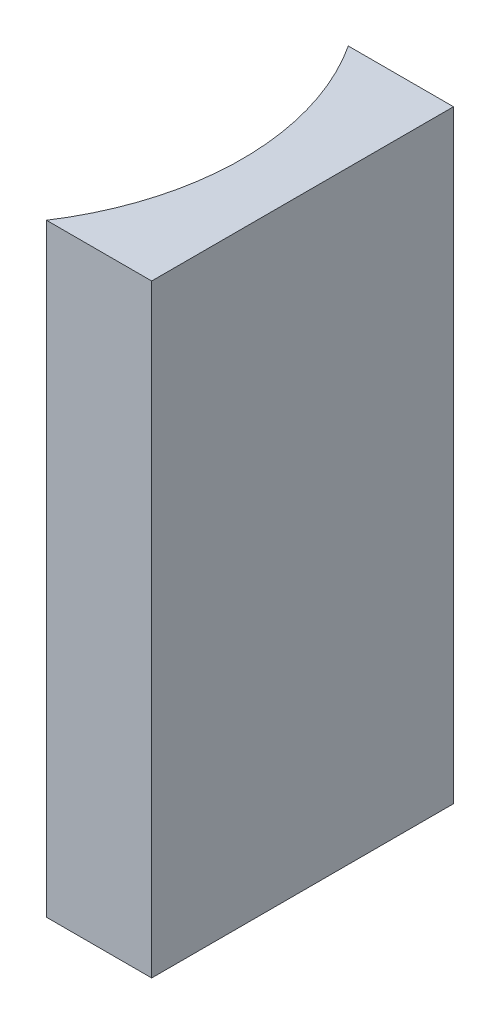
ISO-10303-21;
HEADER;
FILE_DESCRIPTION(('STEP AP214'),'2;1');
FILE_NAME('part.step','',(''),(''),'','','');
FILE_SCHEMA(('AUTOMOTIVE_DESIGN { 1 0 10303 214 1 1 1 1 }'));
ENDSEC;
DATA;
#1=APPLICATION_CONTEXT('core data for automotive mechanical design processes');
#2=APPLICATION_PROTOCOL_DEFINITION('international standard','automotive_design',2000,#1);
#3=PRODUCT_CONTEXT('',#1,'mechanical');
#4=PRODUCT('Part','Part','',(#3));
#5=PRODUCT_RELATED_PRODUCT_CATEGORY('part','',(#4));
#6=PRODUCT_DEFINITION_FORMATION('','',#4);
#7=PRODUCT_DEFINITION_CONTEXT('part definition',#1,'design');
#8=PRODUCT_DEFINITION('design','',#6,#7);
#9=PRODUCT_DEFINITION_SHAPE('','',#8);
#10=(LENGTH_UNIT() NAMED_UNIT(*) SI_UNIT(.MILLI.,.METRE.));
#11=(NAMED_UNIT(*) PLANE_ANGLE_UNIT() SI_UNIT($,.RADIAN.));
#12=(NAMED_UNIT(*) SI_UNIT($,.STERADIAN.) SOLID_ANGLE_UNIT());
#13=UNCERTAINTY_MEASURE_WITH_UNIT(LENGTH_MEASURE(1.E-05),#10,'distance_accuracy_value','');
#14=(GEOMETRIC_REPRESENTATION_CONTEXT(3) GLOBAL_UNCERTAINTY_ASSIGNED_CONTEXT((#13)) GLOBAL_UNIT_ASSIGNED_CONTEXT((#10,
#11,#12)) REPRESENTATION_CONTEXT('',''));
#15=CARTESIAN_POINT('',(0.,0.,0.));
#16=DIRECTION('',(0.,0.,1.));
#17=DIRECTION('',(1.,0.,0.));
#18=AXIS2_PLACEMENT_3D('',#15,#16,#17);
#19=CARTESIAN_POINT('',(0.,20.,0.));
#20=DIRECTION('',(0.,0.,1.));
#21=DIRECTION('',(1.,0.,0.));
#22=AXIS2_PLACEMENT_3D('',#19,#20,#21);
#23=PLANE('',#22);
#24=DIRECTION('',(-1.,0.,0.));
#25=VECTOR('',#24,1.);
#26=CARTESIAN_POINT('',(0.,0.,0.));
#27=LINE('',#26,#25);
#28=CARTESIAN_POINT('',(0.,0.,0.));
#29=VERTEX_POINT('',#28);
#30=CARTESIAN_POINT('',(-3.48500162866467,0.,0.));
#31=VERTEX_POINT('',#30);
#32=EDGE_CURVE('E98',#29,#31,#27,.T.);
#33=ORIENTED_EDGE('',*,*,#32,.T.);
#34=DIRECTION('',(0.,-1.,0.));
#35=VECTOR('',#34,1.);
#36=CARTESIAN_POINT('',(-3.48500162866467,20.,0.));
#37=LINE('',#36,#35);
#38=CARTESIAN_POINT('',(-3.48500162866467,20.,0.));
#39=VERTEX_POINT('',#38);
#40=EDGE_CURVE('E11',#39,#31,#37,.T.);
#41=ORIENTED_EDGE('',*,*,#40,.F.);
#42=DIRECTION('',(-1.,0.,0.));
#43=VECTOR('',#42,1.);
#44=CARTESIAN_POINT('',(0.,20.,0.));
#45=LINE('',#44,#43);
#46=CARTESIAN_POINT('',(0.,20.,0.));
#47=VERTEX_POINT('',#46);
#48=EDGE_CURVE('E86',#47,#39,#45,.T.);
#49=ORIENTED_EDGE('',*,*,#48,.F.);
#50=DIRECTION('',(0.,-1.,0.));
#51=VECTOR('',#50,1.);
#52=CARTESIAN_POINT('',(0.,20.,0.));
#53=LINE('',#52,#51);
#54=EDGE_CURVE('E94',#47,#29,#53,.T.);
#55=ORIENTED_EDGE('',*,*,#54,.T.);
#56=EDGE_LOOP('',(#33,#41,#49,#55));
#57=FACE_BOUND('',#56,.T.);
#58=ADVANCED_FACE('F35',(#57),#23,.F.);
#59=CARTESIAN_POINT('',(-11.16,20.,5.));
#60=DIRECTION('',(0.,-1.,0.));
#61=DIRECTION('',(0.,0.,-1.));
#62=AXIS2_PLACEMENT_3D('',#59,#60,#61);
#63=CYLINDRICAL_SURFACE('',#62,9.16);
#64=CARTESIAN_POINT('',(-11.16,0.,5.));
#65=DIRECTION('',(0.,-1.,0.));
#66=DIRECTION('',(0.,0.,1.));
#67=AXIS2_PLACEMENT_3D('',#64,#65,#66);
#68=CIRCLE('',#67,9.16);
#69=CARTESIAN_POINT('',(-3.48500162866467,0.,10.));
#70=VERTEX_POINT('',#69);
#71=EDGE_CURVE('E90',#31,#70,#68,.T.);
#72=ORIENTED_EDGE('',*,*,#71,.T.);
#73=DIRECTION('',(0.,-1.,0.));
#74=VECTOR('',#73,1.);
#75=CARTESIAN_POINT('',(-3.48500162866467,20.,10.));
#76=LINE('',#75,#74);
#77=CARTESIAN_POINT('',(-3.48500162866467,20.,10.));
#78=VERTEX_POINT('',#77);
#79=EDGE_CURVE('E43',#78,#70,#76,.T.);
#80=ORIENTED_EDGE('',*,*,#79,.F.);
#81=CARTESIAN_POINT('',(-11.16,20.,5.));
#82=DIRECTION('',(0.,-1.,0.));
#83=DIRECTION('',(0.,0.,1.));
#84=AXIS2_PLACEMENT_3D('',#81,#82,#83);
#85=CIRCLE('',#84,9.16);
#86=EDGE_CURVE('E81',#39,#78,#85,.T.);
#87=ORIENTED_EDGE('',*,*,#86,.F.);
#88=ORIENTED_EDGE('',*,*,#40,.T.);
#89=EDGE_LOOP('',(#72,#80,#87,#88));
#90=FACE_BOUND('',#89,.T.);
#91=ADVANCED_FACE('F89',(#90),#63,.F.);
#92=CARTESIAN_POINT('',(0.,20.,10.));
#93=DIRECTION('',(0.,0.,-1.));
#94=DIRECTION('',(-1.,0.,0.));
#95=AXIS2_PLACEMENT_3D('',#92,#93,#94);
#96=PLANE('',#95);
#97=DIRECTION('',(1.,0.,0.));
#98=VECTOR('',#97,1.);
#99=CARTESIAN_POINT('',(0.,0.,10.));
#100=LINE('',#99,#98);
#101=CARTESIAN_POINT('',(0.,0.,10.));
#102=VERTEX_POINT('',#101);
#103=EDGE_CURVE('E68',#70,#102,#100,.T.);
#104=ORIENTED_EDGE('',*,*,#103,.T.);
#105=DIRECTION('',(0.,-1.,0.));
#106=VECTOR('',#105,1.);
#107=CARTESIAN_POINT('',(0.,20.,10.));
#108=LINE('',#107,#106);
#109=CARTESIAN_POINT('',(0.,20.,10.));
#110=VERTEX_POINT('',#109);
#111=EDGE_CURVE('E91',#110,#102,#108,.T.);
#112=ORIENTED_EDGE('',*,*,#111,.F.);
#113=DIRECTION('',(1.,0.,0.));
#114=VECTOR('',#113,1.);
#115=CARTESIAN_POINT('',(0.,20.,10.));
#116=LINE('',#115,#114);
#117=EDGE_CURVE('E84',#78,#110,#116,.T.);
#118=ORIENTED_EDGE('',*,*,#117,.F.);
#119=ORIENTED_EDGE('',*,*,#79,.T.);
#120=EDGE_LOOP('',(#104,#112,#118,#119));
#121=FACE_BOUND('',#120,.T.);
#122=ADVANCED_FACE('F92',(#121),#96,.F.);
#123=CARTESIAN_POINT('',(0.,20.,0.));
#124=DIRECTION('',(-1.,0.,0.));
#125=DIRECTION('',(0.,0.,1.));
#126=AXIS2_PLACEMENT_3D('',#123,#124,#125);
#127=PLANE('',#126);
#128=DIRECTION('',(0.,0.,-1.));
#129=VECTOR('',#128,1.);
#130=CARTESIAN_POINT('',(0.,0.,0.));
#131=LINE('',#130,#129);
#132=EDGE_CURVE('E74',#102,#29,#131,.T.);
#133=ORIENTED_EDGE('',*,*,#132,.T.);
#134=ORIENTED_EDGE('',*,*,#54,.F.);
#135=DIRECTION('',(0.,0.,-1.));
#136=VECTOR('',#135,1.);
#137=CARTESIAN_POINT('',(0.,20.,0.));
#138=LINE('',#137,#136);
#139=EDGE_CURVE('E51',#110,#47,#138,.T.);
#140=ORIENTED_EDGE('',*,*,#139,.F.);
#141=ORIENTED_EDGE('',*,*,#111,.T.);
#142=EDGE_LOOP('',(#133,#134,#140,#141));
#143=FACE_BOUND('',#142,.T.);
#144=ADVANCED_FACE('F105',(#143),#127,.F.);
#145=CARTESIAN_POINT('',(-11.16,20.,5.));
#146=DIRECTION('',(0.,1.,0.));
#147=DIRECTION('',(0.,0.,1.));
#148=AXIS2_PLACEMENT_3D('',#145,#146,#147);
#149=PLANE('',#148);
#150=ORIENTED_EDGE('',*,*,#48,.T.);
#151=ORIENTED_EDGE('',*,*,#86,.T.);
#152=ORIENTED_EDGE('',*,*,#117,.T.);
#153=ORIENTED_EDGE('',*,*,#139,.T.);
#154=EDGE_LOOP('',(#150,#151,#152,#153));
#155=FACE_BOUND('',#154,.T.);
#156=ADVANCED_FACE('F82',(#155),#149,.T.);
#157=CARTESIAN_POINT('',(-11.16,0.,5.));
#158=DIRECTION('',(0.,1.,0.));
#159=DIRECTION('',(0.,0.,1.));
#160=AXIS2_PLACEMENT_3D('',#157,#158,#159);
#161=PLANE('',#160);
#162=ORIENTED_EDGE('',*,*,#32,.F.);
#163=ORIENTED_EDGE('',*,*,#132,.F.);
#164=ORIENTED_EDGE('',*,*,#103,.F.);
#165=ORIENTED_EDGE('',*,*,#71,.F.);
#166=EDGE_LOOP('',(#162,#163,#164,#165));
#167=FACE_BOUND('',#166,.T.);
#168=ADVANCED_FACE('F108',(#167),#161,.F.);
#169=CLOSED_SHELL('',(#58,#91,#122,#144,#156,#168));
#170=MANIFOLD_SOLID_BREP('B2',#169);
#171=ADVANCED_BREP_SHAPE_REPRESENTATION('',(#18,#170),#14);
#172=SHAPE_DEFINITION_REPRESENTATION(#9,#171);
ENDSEC;
END-ISO-10303-21;
